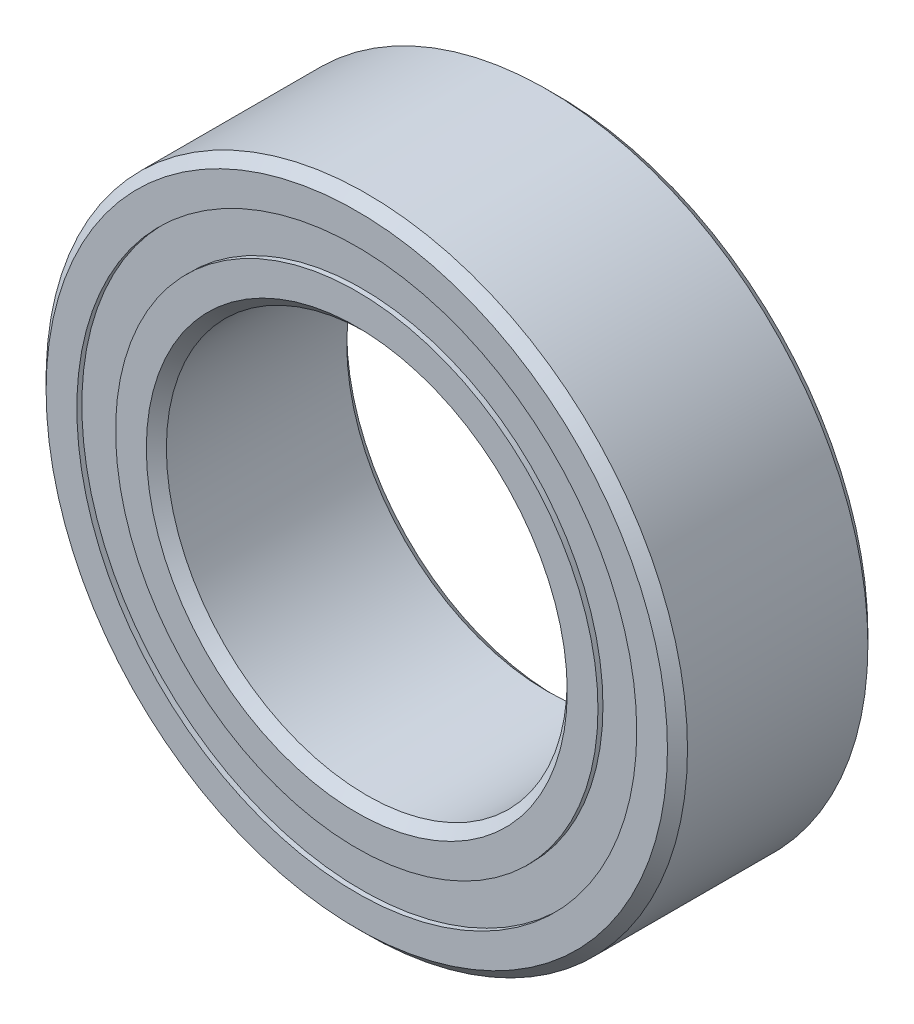
ISO-10303-21;
HEADER;
FILE_DESCRIPTION(('STEP AP214'),'2;1');
FILE_NAME('part.step','',(''),(''),'','','');
FILE_SCHEMA(('AUTOMOTIVE_DESIGN { 1 0 10303 214 1 1 1 1 }'));
ENDSEC;
DATA;
#1=APPLICATION_CONTEXT('core data for automotive mechanical design processes');
#2=APPLICATION_PROTOCOL_DEFINITION('international standard','automotive_design',2000,#1);
#3=PRODUCT_CONTEXT('',#1,'mechanical');
#4=PRODUCT('Part','Part','',(#3));
#5=PRODUCT_RELATED_PRODUCT_CATEGORY('part','',(#4));
#6=PRODUCT_DEFINITION_FORMATION('','',#4);
#7=PRODUCT_DEFINITION_CONTEXT('part definition',#1,'design');
#8=PRODUCT_DEFINITION('design','',#6,#7);
#9=PRODUCT_DEFINITION_SHAPE('','',#8);
#10=(LENGTH_UNIT() NAMED_UNIT(*) SI_UNIT(.MILLI.,.METRE.));
#11=(NAMED_UNIT(*) PLANE_ANGLE_UNIT() SI_UNIT($,.RADIAN.));
#12=(NAMED_UNIT(*) SI_UNIT($,.STERADIAN.) SOLID_ANGLE_UNIT());
#13=UNCERTAINTY_MEASURE_WITH_UNIT(LENGTH_MEASURE(1.E-05),#10,'distance_accuracy_value','');
#14=(GEOMETRIC_REPRESENTATION_CONTEXT(3) GLOBAL_UNCERTAINTY_ASSIGNED_CONTEXT((#13)) GLOBAL_UNIT_ASSIGNED_CONTEXT((#10,
#11,#12)) REPRESENTATION_CONTEXT('',''));
#15=CARTESIAN_POINT('',(0.,0.,0.));
#16=DIRECTION('',(0.,0.,1.));
#17=DIRECTION('',(1.,0.,0.));
#18=AXIS2_PLACEMENT_3D('',#15,#16,#17);
#19=CARTESIAN_POINT('',(0.,3.49175824175824,-1.1875));
#20=DIRECTION('',(0.,0.,1.));
#21=DIRECTION('',(1.,0.,0.));
#22=AXIS2_PLACEMENT_3D('',#19,#20,#21);
#23=PLANE('',#22);
#24=CARTESIAN_POINT('',(0.,0.,-1.1875));
#25=DIRECTION('',(0.,0.,1.));
#26=DIRECTION('',(1.,0.,0.));
#27=AXIS2_PLACEMENT_3D('',#24,#25,#26);
#28=CIRCLE('',#27,3.49175824175824);
#29=CARTESIAN_POINT('',(3.49175824175824,0.,-1.1875));
#30=VERTEX_POINT('',#29);
#31=EDGE_CURVE('E54',#30,#30,#28,.T.);
#32=ORIENTED_EDGE('',*,*,#31,.F.);
#33=EDGE_LOOP('',(#32));
#34=FACE_BOUND('',#33,.T.);
#35=CARTESIAN_POINT('',(0.,0.,-1.1875));
#36=DIRECTION('',(0.,0.,1.));
#37=DIRECTION('',(1.,0.,0.));
#38=AXIS2_PLACEMENT_3D('',#35,#36,#37);
#39=CIRCLE('',#38,3.00824175824176);
#40=CARTESIAN_POINT('',(3.00824175824176,0.,-1.1875));
#41=VERTEX_POINT('',#40);
#42=EDGE_CURVE('E11',#41,#41,#39,.T.);
#43=ORIENTED_EDGE('',*,*,#42,.T.);
#44=EDGE_LOOP('',(#43));
#45=FACE_BOUND('',#44,.T.);
#46=ADVANCED_FACE('F40',(#34,#45),#23,.F.);
#47=CARTESIAN_POINT('',(0.,0.,1.25));
#48=DIRECTION('',(0.,0.,1.));
#49=DIRECTION('',(1.,0.,0.));
#50=AXIS2_PLACEMENT_3D('',#47,#48,#49);
#51=CYLINDRICAL_SURFACE('',#50,3.00824175824176);
#52=ORIENTED_EDGE('',*,*,#42,.F.);
#53=EDGE_LOOP('',(#52));
#54=FACE_BOUND('',#53,.T.);
#55=CARTESIAN_POINT('',(0.,0.,-0.605878719519574));
#56=DIRECTION('',(0.,0.,1.));
#57=DIRECTION('',(1.,0.,0.));
#58=AXIS2_PLACEMENT_3D('',#55,#56,#57);
#59=CIRCLE('',#58,3.00824175824176);
#60=CARTESIAN_POINT('',(3.00824175824176,0.,-0.605878719519574));
#61=VERTEX_POINT('',#60);
#62=EDGE_CURVE('E46',#61,#61,#59,.T.);
#63=ORIENTED_EDGE('',*,*,#62,.T.);
#64=EDGE_LOOP('',(#63));
#65=FACE_BOUND('',#64,.T.);
#66=ADVANCED_FACE('F63',(#54,#65),#51,.F.);
#67=CARTESIAN_POINT('',(0.,3.49175824175824,-0.605878719519574));
#68=DIRECTION('',(0.,0.,-1.));
#69=DIRECTION('',(-1.,0.,0.));
#70=AXIS2_PLACEMENT_3D('',#67,#68,#69);
#71=PLANE('',#70);
#72=ORIENTED_EDGE('',*,*,#62,.F.);
#73=EDGE_LOOP('',(#72));
#74=FACE_BOUND('',#73,.T.);
#75=CARTESIAN_POINT('',(0.,0.,-0.605878719519574));
#76=DIRECTION('',(0.,0.,1.));
#77=DIRECTION('',(1.,0.,0.));
#78=AXIS2_PLACEMENT_3D('',#75,#76,#77);
#79=CIRCLE('',#78,3.49175824175824);
#80=CARTESIAN_POINT('',(3.49175824175824,0.,-0.605878719519574));
#81=VERTEX_POINT('',#80);
#82=EDGE_CURVE('E50',#81,#81,#79,.T.);
#83=ORIENTED_EDGE('',*,*,#82,.T.);
#84=EDGE_LOOP('',(#83));
#85=FACE_BOUND('',#84,.T.);
#86=ADVANCED_FACE('F67',(#74,#85),#71,.F.);
#87=CARTESIAN_POINT('',(0.,0.,1.25));
#88=DIRECTION('',(0.,0.,1.));
#89=DIRECTION('',(1.,0.,0.));
#90=AXIS2_PLACEMENT_3D('',#87,#88,#89);
#91=CYLINDRICAL_SURFACE('',#90,3.49175824175824);
#92=ORIENTED_EDGE('',*,*,#82,.F.);
#93=EDGE_LOOP('',(#92));
#94=FACE_BOUND('',#93,.T.);
#95=ORIENTED_EDGE('',*,*,#31,.T.);
#96=EDGE_LOOP('',(#95));
#97=FACE_BOUND('',#96,.T.);
#98=ADVANCED_FACE('F60',(#94,#97),#91,.T.);
#99=CLOSED_SHELL('',(#46,#66,#86,#98));
#100=MANIFOLD_SOLID_BREP('B2',#99);
#101=CARTESIAN_POINT('',(0.,3.49175824175824,1.1875));
#102=DIRECTION('',(0.,0.,-1.));
#103=DIRECTION('',(-1.,0.,0.));
#104=AXIS2_PLACEMENT_3D('',#101,#102,#103);
#105=PLANE('',#104);
#106=CARTESIAN_POINT('',(0.,0.,1.1875));
#107=DIRECTION('',(0.,0.,1.));
#108=DIRECTION('',(1.,0.,0.));
#109=AXIS2_PLACEMENT_3D('',#106,#107,#108);
#110=CIRCLE('',#109,3.00824175824176);
#111=CARTESIAN_POINT('',(3.00824175824176,0.,1.1875));
#112=VERTEX_POINT('',#111);
#113=EDGE_CURVE('E39',#112,#112,#110,.T.);
#114=ORIENTED_EDGE('',*,*,#113,.F.);
#115=EDGE_LOOP('',(#114));
#116=FACE_BOUND('',#115,.T.);
#117=CARTESIAN_POINT('',(0.,0.,1.1875));
#118=DIRECTION('',(0.,0.,1.));
#119=DIRECTION('',(1.,0.,0.));
#120=AXIS2_PLACEMENT_3D('',#117,#118,#119);
#121=CIRCLE('',#120,3.49175824175824);
#122=CARTESIAN_POINT('',(3.49175824175824,0.,1.1875));
#123=VERTEX_POINT('',#122);
#124=EDGE_CURVE('E122',#123,#123,#121,.T.);
#125=ORIENTED_EDGE('',*,*,#124,.T.);
#126=EDGE_LOOP('',(#125));
#127=FACE_BOUND('',#126,.T.);
#128=ADVANCED_FACE('F108',(#116,#127),#105,.F.);
#129=CARTESIAN_POINT('',(0.,0.,1.25));
#130=DIRECTION('',(0.,0.,1.));
#131=DIRECTION('',(1.,0.,0.));
#132=AXIS2_PLACEMENT_3D('',#129,#130,#131);
#133=CYLINDRICAL_SURFACE('',#132,3.00824175824176);
#134=CARTESIAN_POINT('',(0.,0.,0.605878719519573));
#135=DIRECTION('',(0.,0.,1.));
#136=DIRECTION('',(1.,0.,0.));
#137=AXIS2_PLACEMENT_3D('',#134,#135,#136);
#138=CIRCLE('',#137,3.00824175824176);
#139=CARTESIAN_POINT('',(3.00824175824176,0.,0.605878719519573));
#140=VERTEX_POINT('',#139);
#141=EDGE_CURVE('E114',#140,#140,#138,.T.);
#142=ORIENTED_EDGE('',*,*,#141,.F.);
#143=EDGE_LOOP('',(#142));
#144=FACE_BOUND('',#143,.T.);
#145=ORIENTED_EDGE('',*,*,#113,.T.);
#146=EDGE_LOOP('',(#145));
#147=FACE_BOUND('',#146,.T.);
#148=ADVANCED_FACE('F137',(#144,#147),#133,.F.);
#149=CARTESIAN_POINT('',(0.,3.49175824175824,0.605878719519573));
#150=DIRECTION('',(0.,0.,1.));
#151=DIRECTION('',(1.,0.,0.));
#152=AXIS2_PLACEMENT_3D('',#149,#150,#151);
#153=PLANE('',#152);
#154=CARTESIAN_POINT('',(0.,0.,0.605878719519573));
#155=DIRECTION('',(0.,0.,1.));
#156=DIRECTION('',(1.,0.,0.));
#157=AXIS2_PLACEMENT_3D('',#154,#155,#156);
#158=CIRCLE('',#157,3.49175824175824);
#159=CARTESIAN_POINT('',(3.49175824175824,0.,0.605878719519573));
#160=VERTEX_POINT('',#159);
#161=EDGE_CURVE('E118',#160,#160,#158,.T.);
#162=ORIENTED_EDGE('',*,*,#161,.F.);
#163=EDGE_LOOP('',(#162));
#164=FACE_BOUND('',#163,.T.);
#165=ORIENTED_EDGE('',*,*,#141,.T.);
#166=EDGE_LOOP('',(#165));
#167=FACE_BOUND('',#166,.T.);
#168=ADVANCED_FACE('F132',(#164,#167),#153,.F.);
#169=CARTESIAN_POINT('',(0.,0.,1.25));
#170=DIRECTION('',(0.,0.,1.));
#171=DIRECTION('',(1.,0.,0.));
#172=AXIS2_PLACEMENT_3D('',#169,#170,#171);
#173=CYLINDRICAL_SURFACE('',#172,3.49175824175824);
#174=ORIENTED_EDGE('',*,*,#124,.F.);
#175=EDGE_LOOP('',(#174));
#176=FACE_BOUND('',#175,.T.);
#177=ORIENTED_EDGE('',*,*,#161,.T.);
#178=EDGE_LOOP('',(#177));
#179=FACE_BOUND('',#178,.T.);
#180=ADVANCED_FACE('F129',(#176,#179),#173,.T.);
#181=CLOSED_SHELL('',(#128,#148,#168,#180));
#182=MANIFOLD_SOLID_BREP('B6',#181);
#183=CARTESIAN_POINT('',(-1.62499999999996,2.81458256229945,0.));
#184=DIRECTION('',(0.,0.,1.));
#185=DIRECTION('',(-0.499999999999989,0.866025403784445,0.));
#186=AXIS2_PLACEMENT_3D('',#183,#184,#185);
#187=SPHERICAL_SURFACE('',#186,0.605878719519574);
#188=CARTESIAN_POINT('',(-1.62499999999996,2.81458256229945,0.605878719519573));
#189=VERTEX_POINT('',#188);
#190=VERTEX_LOOP('',#189);
#191=FACE_BOUND('',#190,.T.);
#192=ADVANCED_FACE('F175',(#191),#187,.T.);
#193=CLOSED_SHELL('',(#192));
#194=MANIFOLD_SOLID_BREP('B34',#193);
#195=CARTESIAN_POINT('',(-2.81458256229941,1.62500000000003,0.));
#196=DIRECTION('',(0.,0.,1.));
#197=DIRECTION('',(-0.866025403784433,0.50000000000001,0.));
#198=AXIS2_PLACEMENT_3D('',#195,#196,#197);
#199=SPHERICAL_SURFACE('',#198,0.605878719519574);
#200=CARTESIAN_POINT('',(-2.81458256229941,1.62500000000003,0.605878719519573));
#201=VERTEX_POINT('',#200);
#202=VERTEX_LOOP('',#201);
#203=FACE_BOUND('',#202,.T.);
#204=ADVANCED_FACE('F195',(#203),#199,.T.);
#205=CLOSED_SHELL('',(#204));
#206=MANIFOLD_SOLID_BREP('B104',#205);
#207=CARTESIAN_POINT('',(-3.25,0.,0.));
#208=DIRECTION('',(0.,0.,1.));
#209=DIRECTION('',(-1.,0.,0.));
#210=AXIS2_PLACEMENT_3D('',#207,#208,#209);
#211=SPHERICAL_SURFACE('',#210,0.605878719519574);
#212=CARTESIAN_POINT('',(-3.25,0.,0.605878719519573));
#213=VERTEX_POINT('',#212);
#214=VERTEX_LOOP('',#213);
#215=FACE_BOUND('',#214,.T.);
#216=ADVANCED_FACE('F215',(#215),#211,.T.);
#217=CLOSED_SHELL('',(#216));
#218=MANIFOLD_SOLID_BREP('B171',#217);
#219=CARTESIAN_POINT('',(-2.81458256229944,-1.62499999999997,0.));
#220=DIRECTION('',(0.,0.,1.));
#221=DIRECTION('',(-0.866025403784443,-0.499999999999992,0.));
#222=AXIS2_PLACEMENT_3D('',#219,#220,#221);
#223=SPHERICAL_SURFACE('',#222,0.605878719519574);
#224=CARTESIAN_POINT('',(-2.81458256229944,-1.62499999999997,0.605878719519573));
#225=VERTEX_POINT('',#224);
#226=VERTEX_LOOP('',#225);
#227=FACE_BOUND('',#226,.T.);
#228=ADVANCED_FACE('F235',(#227),#223,.T.);
#229=CLOSED_SHELL('',(#228));
#230=MANIFOLD_SOLID_BREP('B191',#229);
#231=CARTESIAN_POINT('',(-1.62500000000002,-2.81458256229941,0.));
#232=DIRECTION('',(0.,0.,1.));
#233=DIRECTION('',(-0.500000000000007,-0.866025403784435,0.));
#234=AXIS2_PLACEMENT_3D('',#231,#232,#233);
#235=SPHERICAL_SURFACE('',#234,0.605878719519574);
#236=CARTESIAN_POINT('',(-1.62500000000002,-2.81458256229941,0.605878719519573));
#237=VERTEX_POINT('',#236);
#238=VERTEX_LOOP('',#237);
#239=FACE_BOUND('',#238,.T.);
#240=ADVANCED_FACE('F255',(#239),#235,.T.);
#241=CLOSED_SHELL('',(#240));
#242=MANIFOLD_SOLID_BREP('B211',#241);
#243=CARTESIAN_POINT('',(0.,-3.25,0.));
#244=DIRECTION('',(0.,0.,1.));
#245=DIRECTION('',(0.,-1.,0.));
#246=AXIS2_PLACEMENT_3D('',#243,#244,#245);
#247=SPHERICAL_SURFACE('',#246,0.605878719519574);
#248=CARTESIAN_POINT('',(0.,-3.25,0.605878719519573));
#249=VERTEX_POINT('',#248);
#250=VERTEX_LOOP('',#249);
#251=FACE_BOUND('',#250,.T.);
#252=ADVANCED_FACE('F275',(#251),#247,.T.);
#253=CLOSED_SHELL('',(#252));
#254=MANIFOLD_SOLID_BREP('B231',#253);
#255=CARTESIAN_POINT('',(1.62499999999998,-2.81458256229944,0.));
#256=DIRECTION('',(0.,0.,1.));
#257=DIRECTION('',(0.499999999999995,-0.866025403784442,0.));
#258=AXIS2_PLACEMENT_3D('',#255,#256,#257);
#259=SPHERICAL_SURFACE('',#258,0.605878719519574);
#260=CARTESIAN_POINT('',(1.62499999999998,-2.81458256229944,0.605878719519573));
#261=VERTEX_POINT('',#260);
#262=VERTEX_LOOP('',#261);
#263=FACE_BOUND('',#262,.T.);
#264=ADVANCED_FACE('F295',(#263),#259,.T.);
#265=CLOSED_SHELL('',(#264));
#266=MANIFOLD_SOLID_BREP('B251',#265);
#267=CARTESIAN_POINT('',(2.81458256229942,-1.62500000000001,0.));
#268=DIRECTION('',(0.,0.,1.));
#269=DIRECTION('',(0.866025403784436,-0.500000000000004,0.));
#270=AXIS2_PLACEMENT_3D('',#267,#268,#269);
#271=SPHERICAL_SURFACE('',#270,0.605878719519574);
#272=CARTESIAN_POINT('',(2.81458256229942,-1.62500000000001,0.605878719519573));
#273=VERTEX_POINT('',#272);
#274=VERTEX_LOOP('',#273);
#275=FACE_BOUND('',#274,.T.);
#276=ADVANCED_FACE('F315',(#275),#271,.T.);
#277=CLOSED_SHELL('',(#276));
#278=MANIFOLD_SOLID_BREP('B271',#277);
#279=CARTESIAN_POINT('',(3.25,0.,0.));
#280=DIRECTION('',(0.,0.,1.));
#281=DIRECTION('',(1.,0.,0.));
#282=AXIS2_PLACEMENT_3D('',#279,#280,#281);
#283=SPHERICAL_SURFACE('',#282,0.605878719519574);
#284=CARTESIAN_POINT('',(3.25,0.,0.605878719519573));
#285=VERTEX_POINT('',#284);
#286=VERTEX_LOOP('',#285);
#287=FACE_BOUND('',#286,.T.);
#288=ADVANCED_FACE('F335',(#287),#283,.T.);
#289=CLOSED_SHELL('',(#288));
#290=MANIFOLD_SOLID_BREP('B291',#289);
#291=CARTESIAN_POINT('',(2.81458256229943,1.62499999999999,0.));
#292=DIRECTION('',(0.,0.,1.));
#293=DIRECTION('',(0.86602540378444,0.499999999999998,0.));
#294=AXIS2_PLACEMENT_3D('',#291,#292,#293);
#295=SPHERICAL_SURFACE('',#294,0.605878719519574);
#296=CARTESIAN_POINT('',(2.81458256229943,1.62499999999999,0.605878719519573));
#297=VERTEX_POINT('',#296);
#298=VERTEX_LOOP('',#297);
#299=FACE_BOUND('',#298,.T.);
#300=ADVANCED_FACE('F355',(#299),#295,.T.);
#301=CLOSED_SHELL('',(#300));
#302=MANIFOLD_SOLID_BREP('B311',#301);
#303=CARTESIAN_POINT('',(1.625,2.81458256229942,0.));
#304=DIRECTION('',(0.,0.,1.));
#305=DIRECTION('',(0.500000000000001,0.866025403784438,0.));
#306=AXIS2_PLACEMENT_3D('',#303,#304,#305);
#307=SPHERICAL_SURFACE('',#306,0.605878719519574);
#308=CARTESIAN_POINT('',(1.625,2.81458256229942,0.605878719519573));
#309=VERTEX_POINT('',#308);
#310=VERTEX_LOOP('',#309);
#311=FACE_BOUND('',#310,.T.);
#312=ADVANCED_FACE('F375',(#311),#307,.T.);
#313=CLOSED_SHELL('',(#312));
#314=MANIFOLD_SOLID_BREP('B331',#313);
#315=CARTESIAN_POINT('',(0.,3.25,0.));
#316=DIRECTION('',(0.,0.,1.));
#317=DIRECTION('',(0.,1.,0.));
#318=AXIS2_PLACEMENT_3D('',#315,#316,#317);
#319=SPHERICAL_SURFACE('',#318,0.605878719519574);
#320=CARTESIAN_POINT('',(0.,3.25,0.605878719519573));
#321=VERTEX_POINT('',#320);
#322=VERTEX_LOOP('',#321);
#323=FACE_BOUND('',#322,.T.);
#324=ADVANCED_FACE('F398',(#323),#319,.T.);
#325=CLOSED_SHELL('',(#324));
#326=MANIFOLD_SOLID_BREP('B351',#325);
#327=CARTESIAN_POINT('',(0.,3.00824175824176,1.25));
#328=DIRECTION('',(0.,0.,-1.));
#329=DIRECTION('',(-1.,0.,0.));
#330=AXIS2_PLACEMENT_3D('',#327,#328,#329);
#331=PLANE('',#330);
#332=CARTESIAN_POINT('',(0.,0.,1.25));
#333=DIRECTION('',(0.,0.,1.));
#334=DIRECTION('',(1.,0.,0.));
#335=AXIS2_PLACEMENT_3D('',#332,#333,#334);
#336=CIRCLE('',#335,2.625);
#337=CARTESIAN_POINT('',(2.625,0.,1.25));
#338=VERTEX_POINT('',#337);
#339=EDGE_CURVE('E446',#338,#338,#336,.T.);
#340=ORIENTED_EDGE('',*,*,#339,.F.);
#341=EDGE_LOOP('',(#340));
#342=FACE_BOUND('',#341,.T.);
#343=CARTESIAN_POINT('',(0.,0.,1.25));
#344=DIRECTION('',(0.,0.,1.));
#345=DIRECTION('',(1.,0.,0.));
#346=AXIS2_PLACEMENT_3D('',#343,#344,#345);
#347=CIRCLE('',#346,3.00824175824176);
#348=CARTESIAN_POINT('',(3.00824175824176,0.,1.25));
#349=VERTEX_POINT('',#348);
#350=EDGE_CURVE('E397',#349,#349,#347,.T.);
#351=ORIENTED_EDGE('',*,*,#350,.T.);
#352=EDGE_LOOP('',(#351));
#353=FACE_BOUND('',#352,.T.);
#354=ADVANCED_FACE('F418',(#342,#353),#331,.F.);
#355=CARTESIAN_POINT('',(0.,0.,1.25));
#356=DIRECTION('',(0.,0.,1.));
#357=DIRECTION('',(1.,0.,0.));
#358=AXIS2_PLACEMENT_3D('',#355,#356,#357);
#359=CYLINDRICAL_SURFACE('',#358,3.00824175824176);
#360=ORIENTED_EDGE('',*,*,#350,.F.);
#361=EDGE_LOOP('',(#360));
#362=FACE_BOUND('',#361,.T.);
#363=CARTESIAN_POINT('',(0.,0.,0.555555555555555));
#364=DIRECTION('',(0.,0.,1.));
#365=DIRECTION('',(1.,0.,0.));
#366=AXIS2_PLACEMENT_3D('',#363,#364,#365);
#367=CIRCLE('',#366,3.00824175824176);
#368=CARTESIAN_POINT('',(3.00824175824176,0.,0.555555555555555));
#369=VERTEX_POINT('',#368);
#370=EDGE_CURVE('E424',#369,#369,#367,.T.);
#371=ORIENTED_EDGE('',*,*,#370,.T.);
#372=EDGE_LOOP('',(#371));
#373=FACE_BOUND('',#372,.T.);
#374=ADVANCED_FACE('F453',(#362,#373),#359,.T.);
#375=CARTESIAN_POINT('',(0.,0.,0.));
#376=DIRECTION('',(0.,0.,1.));
#377=DIRECTION('',(1.,0.,0.));
#378=AXIS2_PLACEMENT_3D('',#375,#376,#377);
#379=TOROIDAL_SURFACE('',#378,3.25,0.605878719519572);
#380=ORIENTED_EDGE('',*,*,#370,.F.);
#381=EDGE_LOOP('',(#380));
#382=FACE_BOUND('',#381,.T.);
#383=CARTESIAN_POINT('',(0.,0.,-0.555555555555556));
#384=DIRECTION('',(0.,0.,1.));
#385=DIRECTION('',(1.,0.,0.));
#386=AXIS2_PLACEMENT_3D('',#383,#384,#385);
#387=CIRCLE('',#386,3.00824175824176);
#388=CARTESIAN_POINT('',(3.00824175824176,0.,-0.555555555555556));
#389=VERTEX_POINT('',#388);
#390=EDGE_CURVE('E428',#389,#389,#387,.T.);
#391=ORIENTED_EDGE('',*,*,#390,.T.);
#392=EDGE_LOOP('',(#391));
#393=FACE_BOUND('',#392,.T.);
#394=ADVANCED_FACE('F457',(#382,#393),#379,.F.);
#395=CARTESIAN_POINT('',(0.,0.,1.25));
#396=DIRECTION('',(0.,0.,1.));
#397=DIRECTION('',(1.,0.,0.));
#398=AXIS2_PLACEMENT_3D('',#395,#396,#397);
#399=CYLINDRICAL_SURFACE('',#398,3.00824175824176);
#400=ORIENTED_EDGE('',*,*,#390,.F.);
#401=EDGE_LOOP('',(#400));
#402=FACE_BOUND('',#401,.T.);
#403=CARTESIAN_POINT('',(0.,0.,-1.25));
#404=DIRECTION('',(0.,0.,1.));
#405=DIRECTION('',(1.,0.,0.));
#406=AXIS2_PLACEMENT_3D('',#403,#404,#405);
#407=CIRCLE('',#406,3.00824175824176);
#408=CARTESIAN_POINT('',(3.00824175824176,0.,-1.25));
#409=VERTEX_POINT('',#408);
#410=EDGE_CURVE('E432',#409,#409,#407,.T.);
#411=ORIENTED_EDGE('',*,*,#410,.T.);
#412=EDGE_LOOP('',(#411));
#413=FACE_BOUND('',#412,.T.);
#414=ADVANCED_FACE('F462',(#402,#413),#399,.T.);
#415=CARTESIAN_POINT('',(0.,2.625,-1.25));
#416=DIRECTION('',(0.,0.,1.));
#417=DIRECTION('',(1.,0.,0.));
#418=AXIS2_PLACEMENT_3D('',#415,#416,#417);
#419=PLANE('',#418);
#420=ORIENTED_EDGE('',*,*,#410,.F.);
#421=EDGE_LOOP('',(#420));
#422=FACE_BOUND('',#421,.T.);
#423=CARTESIAN_POINT('',(0.,0.,-1.25));
#424=DIRECTION('',(0.,0.,1.));
#425=DIRECTION('',(1.,0.,0.));
#426=AXIS2_PLACEMENT_3D('',#423,#424,#425);
#427=CIRCLE('',#426,2.625);
#428=CARTESIAN_POINT('',(2.625,0.,-1.25));
#429=VERTEX_POINT('',#428);
#430=EDGE_CURVE('E437',#429,#429,#427,.T.);
#431=ORIENTED_EDGE('',*,*,#430,.T.);
#432=EDGE_LOOP('',(#431));
#433=FACE_BOUND('',#432,.T.);
#434=ADVANCED_FACE('F468',(#422,#433),#419,.F.);
#435=CARTESIAN_POINT('',(0.,0.,-1.125));
#436=DIRECTION('',(0.,0.,-1.));
#437=DIRECTION('',(-1.,0.,0.));
#438=AXIS2_PLACEMENT_3D('',#435,#436,#437);
#439=CONICAL_SURFACE('',#438,2.5,0.785398163397443);
#440=ORIENTED_EDGE('',*,*,#430,.F.);
#441=EDGE_LOOP('',(#440));
#442=FACE_BOUND('',#441,.T.);
#443=CARTESIAN_POINT('',(0.,0.,-1.125));
#444=DIRECTION('',(0.,0.,1.));
#445=DIRECTION('',(1.,0.,0.));
#446=AXIS2_PLACEMENT_3D('',#443,#444,#445);
#447=CIRCLE('',#446,2.5);
#448=CARTESIAN_POINT('',(2.5,0.,-1.125));
#449=VERTEX_POINT('',#448);
#450=EDGE_CURVE('E440',#449,#449,#447,.T.);
#451=ORIENTED_EDGE('',*,*,#450,.T.);
#452=EDGE_LOOP('',(#451));
#453=FACE_BOUND('',#452,.T.);
#454=ADVANCED_FACE('F472',(#442,#453),#439,.F.);
#455=CARTESIAN_POINT('',(0.,0.,1.25));
#456=DIRECTION('',(0.,0.,1.));
#457=DIRECTION('',(1.,0.,0.));
#458=AXIS2_PLACEMENT_3D('',#455,#456,#457);
#459=CYLINDRICAL_SURFACE('',#458,2.5);
#460=ORIENTED_EDGE('',*,*,#450,.F.);
#461=EDGE_LOOP('',(#460));
#462=FACE_BOUND('',#461,.T.);
#463=CARTESIAN_POINT('',(0.,0.,1.125));
#464=DIRECTION('',(0.,0.,1.));
#465=DIRECTION('',(1.,0.,0.));
#466=AXIS2_PLACEMENT_3D('',#463,#464,#465);
#467=CIRCLE('',#466,2.5);
#468=CARTESIAN_POINT('',(2.5,0.,1.125));
#469=VERTEX_POINT('',#468);
#470=EDGE_CURVE('E443',#469,#469,#467,.T.);
#471=ORIENTED_EDGE('',*,*,#470,.T.);
#472=EDGE_LOOP('',(#471));
#473=FACE_BOUND('',#472,.T.);
#474=ADVANCED_FACE('F476',(#462,#473),#459,.F.);
#475=CARTESIAN_POINT('',(0.,0.,1.25));
#476=DIRECTION('',(0.,0.,1.));
#477=DIRECTION('',(1.,0.,0.));
#478=AXIS2_PLACEMENT_3D('',#475,#476,#477);
#479=CONICAL_SURFACE('',#478,2.625,0.785398163397454);
#480=ORIENTED_EDGE('',*,*,#470,.F.);
#481=EDGE_LOOP('',(#480));
#482=FACE_BOUND('',#481,.T.);
#483=ORIENTED_EDGE('',*,*,#339,.T.);
#484=EDGE_LOOP('',(#483));
#485=FACE_BOUND('',#484,.T.);
#486=ADVANCED_FACE('F450',(#482,#485),#479,.F.);
#487=CLOSED_SHELL('',(#354,#374,#394,#414,#434,#454,#474,#486));
#488=MANIFOLD_SOLID_BREP('B371',#487);
#489=CARTESIAN_POINT('',(0.,0.,1.125));
#490=DIRECTION('',(0.,0.,-1.));
#491=DIRECTION('',(-1.,0.,0.));
#492=AXIS2_PLACEMENT_3D('',#489,#490,#491);
#493=CONICAL_SURFACE('',#492,4.,0.785398163397446);
#494=CARTESIAN_POINT('',(0.,0.,1.25));
#495=DIRECTION('',(0.,0.,1.));
#496=DIRECTION('',(1.,0.,0.));
#497=AXIS2_PLACEMENT_3D('',#494,#495,#496);
#498=CIRCLE('',#497,3.875);
#499=CARTESIAN_POINT('',(3.875,0.,1.25));
#500=VERTEX_POINT('',#499);
#501=EDGE_CURVE('E568',#500,#500,#498,.T.);
#502=ORIENTED_EDGE('',*,*,#501,.F.);
#503=EDGE_LOOP('',(#502));
#504=FACE_BOUND('',#503,.T.);
#505=CARTESIAN_POINT('',(0.,0.,1.125));
#506=DIRECTION('',(0.,0.,1.));
#507=DIRECTION('',(1.,0.,0.));
#508=AXIS2_PLACEMENT_3D('',#505,#506,#507);
#509=CIRCLE('',#508,4.);
#510=CARTESIAN_POINT('',(4.,0.,1.125));
#511=VERTEX_POINT('',#510);
#512=EDGE_CURVE('E417',#511,#511,#509,.T.);
#513=ORIENTED_EDGE('',*,*,#512,.T.);
#514=EDGE_LOOP('',(#513));
#515=FACE_BOUND('',#514,.T.);
#516=ADVANCED_FACE('F540',(#504,#515),#493,.T.);
#517=CARTESIAN_POINT('',(0.,0.,1.25));
#518=DIRECTION('',(0.,0.,1.));
#519=DIRECTION('',(1.,0.,0.));
#520=AXIS2_PLACEMENT_3D('',#517,#518,#519);
#521=CYLINDRICAL_SURFACE('',#520,4.);
#522=ORIENTED_EDGE('',*,*,#512,.F.);
#523=EDGE_LOOP('',(#522));
#524=FACE_BOUND('',#523,.T.);
#525=CARTESIAN_POINT('',(0.,0.,-1.125));
#526=DIRECTION('',(0.,0.,1.));
#527=DIRECTION('',(1.,0.,0.));
#528=AXIS2_PLACEMENT_3D('',#525,#526,#527);
#529=CIRCLE('',#528,4.);
#530=CARTESIAN_POINT('',(4.,0.,-1.125));
#531=VERTEX_POINT('',#530);
#532=EDGE_CURVE('E546',#531,#531,#529,.T.);
#533=ORIENTED_EDGE('',*,*,#532,.T.);
#534=EDGE_LOOP('',(#533));
#535=FACE_BOUND('',#534,.T.);
#536=ADVANCED_FACE('F575',(#524,#535),#521,.T.);
#537=CARTESIAN_POINT('',(0.,0.,-1.25));
#538=DIRECTION('',(0.,0.,1.));
#539=DIRECTION('',(1.,0.,0.));
#540=AXIS2_PLACEMENT_3D('',#537,#538,#539);
#541=CONICAL_SURFACE('',#540,3.875,0.785398163397443);
#542=ORIENTED_EDGE('',*,*,#532,.F.);
#543=EDGE_LOOP('',(#542));
#544=FACE_BOUND('',#543,.T.);
#545=CARTESIAN_POINT('',(0.,0.,-1.25));
#546=DIRECTION('',(0.,0.,1.));
#547=DIRECTION('',(1.,0.,0.));
#548=AXIS2_PLACEMENT_3D('',#545,#546,#547);
#549=CIRCLE('',#548,3.875);
#550=CARTESIAN_POINT('',(3.875,0.,-1.25));
#551=VERTEX_POINT('',#550);
#552=EDGE_CURVE('E550',#551,#551,#549,.T.);
#553=ORIENTED_EDGE('',*,*,#552,.T.);
#554=EDGE_LOOP('',(#553));
#555=FACE_BOUND('',#554,.T.);
#556=ADVANCED_FACE('F579',(#544,#555),#541,.T.);
#557=CARTESIAN_POINT('',(0.,3.875,-1.25));
#558=DIRECTION('',(0.,0.,1.));
#559=DIRECTION('',(1.,0.,0.));
#560=AXIS2_PLACEMENT_3D('',#557,#558,#559);
#561=PLANE('',#560);
#562=ORIENTED_EDGE('',*,*,#552,.F.);
#563=EDGE_LOOP('',(#562));
#564=FACE_BOUND('',#563,.T.);
#565=CARTESIAN_POINT('',(0.,0.,-1.25));
#566=DIRECTION('',(0.,0.,1.));
#567=DIRECTION('',(1.,0.,0.));
#568=AXIS2_PLACEMENT_3D('',#565,#566,#567);
#569=CIRCLE('',#568,3.49175824175824);
#570=CARTESIAN_POINT('',(3.49175824175824,0.,-1.25));
#571=VERTEX_POINT('',#570);
#572=EDGE_CURVE('E554',#571,#571,#569,.T.);
#573=ORIENTED_EDGE('',*,*,#572,.T.);
#574=EDGE_LOOP('',(#573));
#575=FACE_BOUND('',#574,.T.);
#576=ADVANCED_FACE('F584',(#564,#575),#561,.F.);
#577=CARTESIAN_POINT('',(0.,0.,1.25));
#578=DIRECTION('',(0.,0.,1.));
#579=DIRECTION('',(1.,0.,0.));
#580=AXIS2_PLACEMENT_3D('',#577,#578,#579);
#581=CYLINDRICAL_SURFACE('',#580,3.49175824175824);
#582=ORIENTED_EDGE('',*,*,#572,.F.);
#583=EDGE_LOOP('',(#582));
#584=FACE_BOUND('',#583,.T.);
#585=CARTESIAN_POINT('',(0.,0.,-0.555555555555556));
#586=DIRECTION('',(0.,0.,1.));
#587=DIRECTION('',(1.,0.,0.));
#588=AXIS2_PLACEMENT_3D('',#585,#586,#587);
#589=CIRCLE('',#588,3.49175824175824);
#590=CARTESIAN_POINT('',(3.49175824175824,0.,-0.555555555555556));
#591=VERTEX_POINT('',#590);
#592=EDGE_CURVE('E559',#591,#591,#589,.T.);
#593=ORIENTED_EDGE('',*,*,#592,.T.);
#594=EDGE_LOOP('',(#593));
#595=FACE_BOUND('',#594,.T.);
#596=ADVANCED_FACE('F590',(#584,#595),#581,.F.);
#597=CARTESIAN_POINT('',(0.,0.,0.));
#598=DIRECTION('',(0.,0.,1.));
#599=DIRECTION('',(1.,0.,0.));
#600=AXIS2_PLACEMENT_3D('',#597,#598,#599);
#601=TOROIDAL_SURFACE('',#600,3.25,0.605878719519574);
#602=ORIENTED_EDGE('',*,*,#592,.F.);
#603=EDGE_LOOP('',(#602));
#604=FACE_BOUND('',#603,.T.);
#605=CARTESIAN_POINT('',(0.,0.,0.555555555555555));
#606=DIRECTION('',(0.,0.,1.));
#607=DIRECTION('',(1.,0.,0.));
#608=AXIS2_PLACEMENT_3D('',#605,#606,#607);
#609=CIRCLE('',#608,3.49175824175824);
#610=CARTESIAN_POINT('',(3.49175824175824,0.,0.555555555555555));
#611=VERTEX_POINT('',#610);
#612=EDGE_CURVE('E562',#611,#611,#609,.T.);
#613=ORIENTED_EDGE('',*,*,#612,.T.);
#614=EDGE_LOOP('',(#613));
#615=FACE_BOUND('',#614,.T.);
#616=ADVANCED_FACE('F594',(#604,#615),#601,.F.);
#617=CARTESIAN_POINT('',(0.,0.,1.25));
#618=DIRECTION('',(0.,0.,1.));
#619=DIRECTION('',(1.,0.,0.));
#620=AXIS2_PLACEMENT_3D('',#617,#618,#619);
#621=CYLINDRICAL_SURFACE('',#620,3.49175824175824);
#622=ORIENTED_EDGE('',*,*,#612,.F.);
#623=EDGE_LOOP('',(#622));
#624=FACE_BOUND('',#623,.T.);
#625=CARTESIAN_POINT('',(0.,0.,1.25));
#626=DIRECTION('',(0.,0.,1.));
#627=DIRECTION('',(1.,0.,0.));
#628=AXIS2_PLACEMENT_3D('',#625,#626,#627);
#629=CIRCLE('',#628,3.49175824175824);
#630=CARTESIAN_POINT('',(3.49175824175824,0.,1.25));
#631=VERTEX_POINT('',#630);
#632=EDGE_CURVE('E565',#631,#631,#629,.T.);
#633=ORIENTED_EDGE('',*,*,#632,.T.);
#634=EDGE_LOOP('',(#633));
#635=FACE_BOUND('',#634,.T.);
#636=ADVANCED_FACE('F598',(#624,#635),#621,.F.);
#637=CARTESIAN_POINT('',(0.,3.875,1.25));
#638=DIRECTION('',(0.,0.,-1.));
#639=DIRECTION('',(-1.,0.,0.));
#640=AXIS2_PLACEMENT_3D('',#637,#638,#639);
#641=PLANE('',#640);
#642=ORIENTED_EDGE('',*,*,#632,.F.);
#643=EDGE_LOOP('',(#642));
#644=FACE_BOUND('',#643,.T.);
#645=ORIENTED_EDGE('',*,*,#501,.T.);
#646=EDGE_LOOP('',(#645));
#647=FACE_BOUND('',#646,.T.);
#648=ADVANCED_FACE('F572',(#644,#647),#641,.F.);
#649=CLOSED_SHELL('',(#516,#536,#556,#576,#596,#616,#636,#648));
#650=MANIFOLD_SOLID_BREP('B392',#649);
#651=ADVANCED_BREP_SHAPE_REPRESENTATION('',(#18,#100,#182,#194,#206,#218,#230,#242,#254,#266,
#278,#290,#302,#314,#326,#488,#650),#14);
#652=SHAPE_DEFINITION_REPRESENTATION(#9,#651);
ENDSEC;
END-ISO-10303-21;
